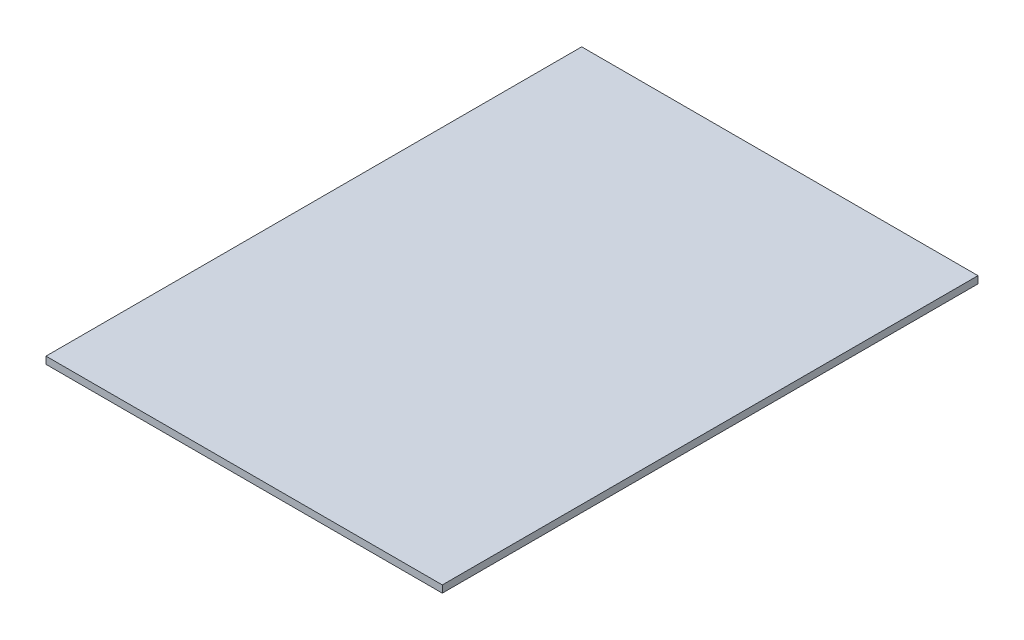
ISO-10303-21;
HEADER;
FILE_DESCRIPTION(('STEP AP214'),'2;1');
FILE_NAME('part.step','',(''),(''),'','','');
FILE_SCHEMA(('AUTOMOTIVE_DESIGN { 1 0 10303 214 1 1 1 1 }'));
ENDSEC;
DATA;
#1=APPLICATION_CONTEXT('core data for automotive mechanical design processes');
#2=APPLICATION_PROTOCOL_DEFINITION('international standard','automotive_design',2000,#1);
#3=PRODUCT_CONTEXT('',#1,'mechanical');
#4=PRODUCT('Part','Part','',(#3));
#5=PRODUCT_RELATED_PRODUCT_CATEGORY('part','',(#4));
#6=PRODUCT_DEFINITION_FORMATION('','',#4);
#7=PRODUCT_DEFINITION_CONTEXT('part definition',#1,'design');
#8=PRODUCT_DEFINITION('design','',#6,#7);
#9=PRODUCT_DEFINITION_SHAPE('','',#8);
#10=(LENGTH_UNIT() NAMED_UNIT(*) SI_UNIT(.MILLI.,.METRE.));
#11=(NAMED_UNIT(*) PLANE_ANGLE_UNIT() SI_UNIT($,.RADIAN.));
#12=(NAMED_UNIT(*) SI_UNIT($,.STERADIAN.) SOLID_ANGLE_UNIT());
#13=UNCERTAINTY_MEASURE_WITH_UNIT(LENGTH_MEASURE(1.E-05),#10,'distance_accuracy_value','');
#14=(GEOMETRIC_REPRESENTATION_CONTEXT(3) GLOBAL_UNCERTAINTY_ASSIGNED_CONTEXT((#13)) GLOBAL_UNIT_ASSIGNED_CONTEXT((#10,
#11,#12)) REPRESENTATION_CONTEXT('',''));
#15=CARTESIAN_POINT('',(0.,0.,0.));
#16=DIRECTION('',(0.,0.,1.));
#17=DIRECTION('',(1.,0.,0.));
#18=AXIS2_PLACEMENT_3D('',#15,#16,#17);
#19=CARTESIAN_POINT('',(1055.878,38.1,-1427.226));
#20=DIRECTION('',(-1.,0.,0.));
#21=DIRECTION('',(0.,0.,1.));
#22=AXIS2_PLACEMENT_3D('',#19,#20,#21);
#23=PLANE('',#22);
#24=DIRECTION('',(0.,0.,-1.));
#25=VECTOR('',#24,1.);
#26=CARTESIAN_POINT('',(1055.878,0.,-1427.226));
#27=LINE('',#26,#25);
#28=CARTESIAN_POINT('',(1055.878,0.,1427.226));
#29=VERTEX_POINT('',#28);
#30=CARTESIAN_POINT('',(1055.878,0.,-1427.226));
#31=VERTEX_POINT('',#30);
#32=EDGE_CURVE('E98',#29,#31,#27,.T.);
#33=ORIENTED_EDGE('',*,*,#32,.T.);
#34=DIRECTION('',(0.,-1.,0.));
#35=VECTOR('',#34,1.);
#36=CARTESIAN_POINT('',(1055.878,38.1,-1427.226));
#37=LINE('',#36,#35);
#38=CARTESIAN_POINT('',(1055.878,38.1,-1427.226));
#39=VERTEX_POINT('',#38);
#40=EDGE_CURVE('E11',#39,#31,#37,.T.);
#41=ORIENTED_EDGE('',*,*,#40,.F.);
#42=DIRECTION('',(0.,0.,-1.));
#43=VECTOR('',#42,1.);
#44=CARTESIAN_POINT('',(1055.878,38.1,-1427.226));
#45=LINE('',#44,#43);
#46=CARTESIAN_POINT('',(1055.878,38.1,1427.226));
#47=VERTEX_POINT('',#46);
#48=EDGE_CURVE('E86',#47,#39,#45,.T.);
#49=ORIENTED_EDGE('',*,*,#48,.F.);
#50=DIRECTION('',(0.,-1.,0.));
#51=VECTOR('',#50,1.);
#52=CARTESIAN_POINT('',(1055.878,38.1,1427.226));
#53=LINE('',#52,#51);
#54=EDGE_CURVE('E94',#47,#29,#53,.T.);
#55=ORIENTED_EDGE('',*,*,#54,.T.);
#56=EDGE_LOOP('',(#33,#41,#49,#55));
#57=FACE_BOUND('',#56,.T.);
#58=ADVANCED_FACE('F35',(#57),#23,.F.);
#59=CARTESIAN_POINT('',(-1055.878,38.1,-1427.226));
#60=DIRECTION('',(0.,0.,1.));
#61=DIRECTION('',(1.,0.,0.));
#62=AXIS2_PLACEMENT_3D('',#59,#60,#61);
#63=PLANE('',#62);
#64=DIRECTION('',(-1.,0.,0.));
#65=VECTOR('',#64,1.);
#66=CARTESIAN_POINT('',(-1055.878,0.,-1427.226));
#67=LINE('',#66,#65);
#68=CARTESIAN_POINT('',(-1055.878,0.,-1427.226));
#69=VERTEX_POINT('',#68);
#70=EDGE_CURVE('E90',#31,#69,#67,.T.);
#71=ORIENTED_EDGE('',*,*,#70,.T.);
#72=DIRECTION('',(0.,-1.,0.));
#73=VECTOR('',#72,1.);
#74=CARTESIAN_POINT('',(-1055.878,38.1,-1427.226));
#75=LINE('',#74,#73);
#76=CARTESIAN_POINT('',(-1055.878,38.1,-1427.226));
#77=VERTEX_POINT('',#76);
#78=EDGE_CURVE('E43',#77,#69,#75,.T.);
#79=ORIENTED_EDGE('',*,*,#78,.F.);
#80=DIRECTION('',(-1.,0.,0.));
#81=VECTOR('',#80,1.);
#82=CARTESIAN_POINT('',(-1055.878,38.1,-1427.226));
#83=LINE('',#82,#81);
#84=EDGE_CURVE('E81',#39,#77,#83,.T.);
#85=ORIENTED_EDGE('',*,*,#84,.F.);
#86=ORIENTED_EDGE('',*,*,#40,.T.);
#87=EDGE_LOOP('',(#71,#79,#85,#86));
#88=FACE_BOUND('',#87,.T.);
#89=ADVANCED_FACE('F89',(#88),#63,.F.);
#90=CARTESIAN_POINT('',(-1055.878,38.1,-1427.226));
#91=DIRECTION('',(1.,0.,0.));
#92=DIRECTION('',(0.,0.,-1.));
#93=AXIS2_PLACEMENT_3D('',#90,#91,#92);
#94=PLANE('',#93);
#95=DIRECTION('',(0.,0.,1.));
#96=VECTOR('',#95,1.);
#97=CARTESIAN_POINT('',(-1055.878,0.,-1427.226));
#98=LINE('',#97,#96);
#99=CARTESIAN_POINT('',(-1055.878,0.,1427.226));
#100=VERTEX_POINT('',#99);
#101=EDGE_CURVE('E68',#69,#100,#98,.T.);
#102=ORIENTED_EDGE('',*,*,#101,.T.);
#103=DIRECTION('',(0.,-1.,0.));
#104=VECTOR('',#103,1.);
#105=CARTESIAN_POINT('',(-1055.878,38.1,1427.226));
#106=LINE('',#105,#104);
#107=CARTESIAN_POINT('',(-1055.878,38.1,1427.226));
#108=VERTEX_POINT('',#107);
#109=EDGE_CURVE('E91',#108,#100,#106,.T.);
#110=ORIENTED_EDGE('',*,*,#109,.F.);
#111=DIRECTION('',(0.,0.,1.));
#112=VECTOR('',#111,1.);
#113=CARTESIAN_POINT('',(-1055.878,38.1,-1427.226));
#114=LINE('',#113,#112);
#115=EDGE_CURVE('E84',#77,#108,#114,.T.);
#116=ORIENTED_EDGE('',*,*,#115,.F.);
#117=ORIENTED_EDGE('',*,*,#78,.T.);
#118=EDGE_LOOP('',(#102,#110,#116,#117));
#119=FACE_BOUND('',#118,.T.);
#120=ADVANCED_FACE('F92',(#119),#94,.F.);
#121=CARTESIAN_POINT('',(-1055.878,38.1,1427.226));
#122=DIRECTION('',(0.,0.,-1.));
#123=DIRECTION('',(-1.,0.,0.));
#124=AXIS2_PLACEMENT_3D('',#121,#122,#123);
#125=PLANE('',#124);
#126=DIRECTION('',(1.,0.,0.));
#127=VECTOR('',#126,1.);
#128=CARTESIAN_POINT('',(-1055.878,0.,1427.226));
#129=LINE('',#128,#127);
#130=EDGE_CURVE('E74',#100,#29,#129,.T.);
#131=ORIENTED_EDGE('',*,*,#130,.T.);
#132=ORIENTED_EDGE('',*,*,#54,.F.);
#133=DIRECTION('',(1.,0.,0.));
#134=VECTOR('',#133,1.);
#135=CARTESIAN_POINT('',(-1055.878,38.1,1427.226));
#136=LINE('',#135,#134);
#137=EDGE_CURVE('E51',#108,#47,#136,.T.);
#138=ORIENTED_EDGE('',*,*,#137,.F.);
#139=ORIENTED_EDGE('',*,*,#109,.T.);
#140=EDGE_LOOP('',(#131,#132,#138,#139));
#141=FACE_BOUND('',#140,.T.);
#142=ADVANCED_FACE('F105',(#141),#125,.F.);
#143=CARTESIAN_POINT('',(0.,38.1,0.));
#144=DIRECTION('',(0.,1.,0.));
#145=DIRECTION('',(0.,0.,1.));
#146=AXIS2_PLACEMENT_3D('',#143,#144,#145);
#147=PLANE('',#146);
#148=ORIENTED_EDGE('',*,*,#48,.T.);
#149=ORIENTED_EDGE('',*,*,#84,.T.);
#150=ORIENTED_EDGE('',*,*,#115,.T.);
#151=ORIENTED_EDGE('',*,*,#137,.T.);
#152=EDGE_LOOP('',(#148,#149,#150,#151));
#153=FACE_BOUND('',#152,.T.);
#154=ADVANCED_FACE('F82',(#153),#147,.T.);
#155=CARTESIAN_POINT('',(0.,0.,0.));
#156=DIRECTION('',(0.,1.,0.));
#157=DIRECTION('',(0.,0.,1.));
#158=AXIS2_PLACEMENT_3D('',#155,#156,#157);
#159=PLANE('',#158);
#160=ORIENTED_EDGE('',*,*,#32,.F.);
#161=ORIENTED_EDGE('',*,*,#130,.F.);
#162=ORIENTED_EDGE('',*,*,#101,.F.);
#163=ORIENTED_EDGE('',*,*,#70,.F.);
#164=EDGE_LOOP('',(#160,#161,#162,#163));
#165=FACE_BOUND('',#164,.T.);
#166=ADVANCED_FACE('F108',(#165),#159,.F.);
#167=CLOSED_SHELL('',(#58,#89,#120,#142,#154,#166));
#168=MANIFOLD_SOLID_BREP('B2',#167);
#169=ADVANCED_BREP_SHAPE_REPRESENTATION('',(#18,#168),#14);
#170=SHAPE_DEFINITION_REPRESENTATION(#9,#169);
ENDSEC;
END-ISO-10303-21;
